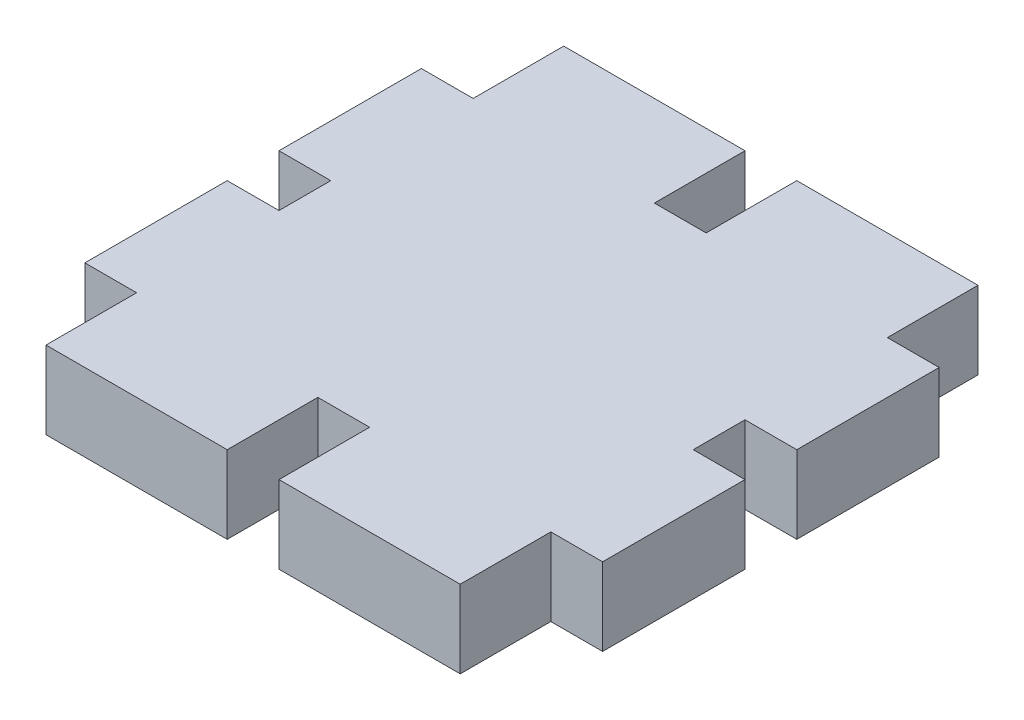
ISO-10303-21;
HEADER;
FILE_DESCRIPTION(('STEP AP214'),'2;1');
FILE_NAME('part.step','',(''),(''),'','','');
FILE_SCHEMA(('AUTOMOTIVE_DESIGN { 1 0 10303 214 1 1 1 1 }'));
ENDSEC;
DATA;
#1=APPLICATION_CONTEXT('core data for automotive mechanical design processes');
#2=APPLICATION_PROTOCOL_DEFINITION('international standard','automotive_design',2000,#1);
#3=PRODUCT_CONTEXT('',#1,'mechanical');
#4=PRODUCT('Part','Part','',(#3));
#5=PRODUCT_RELATED_PRODUCT_CATEGORY('part','',(#4));
#6=PRODUCT_DEFINITION_FORMATION('','',#4);
#7=PRODUCT_DEFINITION_CONTEXT('part definition',#1,'design');
#8=PRODUCT_DEFINITION('design','',#6,#7);
#9=PRODUCT_DEFINITION_SHAPE('','',#8);
#10=(LENGTH_UNIT() NAMED_UNIT(*) SI_UNIT(.MILLI.,.METRE.));
#11=(NAMED_UNIT(*) PLANE_ANGLE_UNIT() SI_UNIT($,.RADIAN.));
#12=(NAMED_UNIT(*) SI_UNIT($,.STERADIAN.) SOLID_ANGLE_UNIT());
#13=UNCERTAINTY_MEASURE_WITH_UNIT(LENGTH_MEASURE(1.E-05),#10,'distance_accuracy_value','');
#14=(GEOMETRIC_REPRESENTATION_CONTEXT(3) GLOBAL_UNCERTAINTY_ASSIGNED_CONTEXT((#13)) GLOBAL_UNIT_ASSIGNED_CONTEXT((#10,
#11,#12)) REPRESENTATION_CONTEXT('',''));
#15=CARTESIAN_POINT('',(0.,0.,0.));
#16=DIRECTION('',(0.,0.,1.));
#17=DIRECTION('',(1.,0.,0.));
#18=AXIS2_PLACEMENT_3D('',#15,#16,#17);
#19=CARTESIAN_POINT('',(1.,3.,0.));
#20=DIRECTION('',(-1.,0.,0.));
#21=DIRECTION('',(0.,0.,1.));
#22=AXIS2_PLACEMENT_3D('',#19,#20,#21);
#23=PLANE('',#22);
#24=DIRECTION('',(0.,0.,-1.));
#25=VECTOR('',#24,1.);
#26=CARTESIAN_POINT('',(1.,0.,0.));
#27=LINE('',#26,#25);
#28=CARTESIAN_POINT('',(1.,0.,-16.5));
#29=VERTEX_POINT('',#28);
#30=CARTESIAN_POINT('',(1.,0.,-20.));
#31=VERTEX_POINT('',#30);
#32=EDGE_CURVE('E253',#29,#31,#27,.T.);
#33=ORIENTED_EDGE('',*,*,#32,.F.);
#34=DIRECTION('',(0.,-1.,0.));
#35=VECTOR('',#34,1.);
#36=CARTESIAN_POINT('',(1.,3.,-16.5));
#37=LINE('',#36,#35);
#38=CARTESIAN_POINT('',(1.,3.,-16.5));
#39=VERTEX_POINT('',#38);
#40=EDGE_CURVE('E11',#39,#29,#37,.T.);
#41=ORIENTED_EDGE('',*,*,#40,.F.);
#42=DIRECTION('',(0.,0.,-1.));
#43=VECTOR('',#42,1.);
#44=CARTESIAN_POINT('',(1.,3.,0.));
#45=LINE('',#44,#43);
#46=CARTESIAN_POINT('',(1.,3.,-20.));
#47=VERTEX_POINT('',#46);
#48=EDGE_CURVE('E319',#39,#47,#45,.T.);
#49=ORIENTED_EDGE('',*,*,#48,.T.);
#50=DIRECTION('',(0.,-1.,0.));
#51=VECTOR('',#50,1.);
#52=CARTESIAN_POINT('',(1.,3.,-20.));
#53=LINE('',#52,#51);
#54=EDGE_CURVE('E55',#47,#31,#53,.T.);
#55=ORIENTED_EDGE('',*,*,#54,.T.);
#56=EDGE_LOOP('',(#33,#41,#49,#55));
#57=FACE_BOUND('',#56,.T.);
#58=ADVANCED_FACE('F39',(#57),#23,.T.);
#59=CARTESIAN_POINT('',(0.,3.,-16.5));
#60=DIRECTION('',(0.,0.,1.));
#61=DIRECTION('',(1.,0.,0.));
#62=AXIS2_PLACEMENT_3D('',#59,#60,#61);
#63=PLANE('',#62);
#64=DIRECTION('',(-1.,0.,0.));
#65=VECTOR('',#64,1.);
#66=CARTESIAN_POINT('',(0.,0.,-16.5));
#67=LINE('',#66,#65);
#68=CARTESIAN_POINT('',(-0.999999999999999,0.,-16.5));
#69=VERTEX_POINT('',#68);
#70=EDGE_CURVE('E255',#29,#69,#67,.T.);
#71=ORIENTED_EDGE('',*,*,#70,.T.);
#72=DIRECTION('',(0.,-1.,0.));
#73=VECTOR('',#72,1.);
#74=CARTESIAN_POINT('',(-0.999999999999999,3.,-16.5));
#75=LINE('',#74,#73);
#76=CARTESIAN_POINT('',(-0.999999999999999,3.,-16.5));
#77=VERTEX_POINT('',#76);
#78=EDGE_CURVE('E47',#77,#69,#75,.T.);
#79=ORIENTED_EDGE('',*,*,#78,.F.);
#80=DIRECTION('',(-1.,0.,0.));
#81=VECTOR('',#80,1.);
#82=CARTESIAN_POINT('',(0.,3.,-16.5));
#83=LINE('',#82,#81);
#84=EDGE_CURVE('E781',#39,#77,#83,.T.);
#85=ORIENTED_EDGE('',*,*,#84,.F.);
#86=ORIENTED_EDGE('',*,*,#40,.T.);
#87=EDGE_LOOP('',(#71,#79,#85,#86));
#88=FACE_BOUND('',#87,.T.);
#89=ADVANCED_FACE('F469',(#88),#63,.F.);
#90=CARTESIAN_POINT('',(-0.999999999999999,3.,0.));
#91=DIRECTION('',(-1.,0.,0.));
#92=DIRECTION('',(0.,0.,1.));
#93=AXIS2_PLACEMENT_3D('',#90,#91,#92);
#94=PLANE('',#93);
#95=DIRECTION('',(0.,0.,-1.));
#96=VECTOR('',#95,1.);
#97=CARTESIAN_POINT('',(-0.999999999999999,0.,0.));
#98=LINE('',#97,#96);
#99=CARTESIAN_POINT('',(-0.999999999999999,0.,-20.));
#100=VERTEX_POINT('',#99);
#101=EDGE_CURVE('E257',#69,#100,#98,.T.);
#102=ORIENTED_EDGE('',*,*,#101,.T.);
#103=DIRECTION('',(0.,-1.,0.));
#104=VECTOR('',#103,1.);
#105=CARTESIAN_POINT('',(-0.999999999999999,3.,-20.));
#106=LINE('',#105,#104);
#107=CARTESIAN_POINT('',(-0.999999999999999,3.,-20.));
#108=VERTEX_POINT('',#107);
#109=EDGE_CURVE('E377',#108,#100,#106,.T.);
#110=ORIENTED_EDGE('',*,*,#109,.F.);
#111=DIRECTION('',(0.,0.,-1.));
#112=VECTOR('',#111,1.);
#113=CARTESIAN_POINT('',(-0.999999999999999,3.,0.));
#114=LINE('',#113,#112);
#115=EDGE_CURVE('E386',#77,#108,#114,.T.);
#116=ORIENTED_EDGE('',*,*,#115,.F.);
#117=ORIENTED_EDGE('',*,*,#78,.T.);
#118=EDGE_LOOP('',(#102,#110,#116,#117));
#119=FACE_BOUND('',#118,.T.);
#120=ADVANCED_FACE('F384',(#119),#94,.F.);
#121=CARTESIAN_POINT('',(0.,3.,-20.));
#122=DIRECTION('',(0.,0.,1.));
#123=DIRECTION('',(1.,0.,0.));
#124=AXIS2_PLACEMENT_3D('',#121,#122,#123);
#125=PLANE('',#124);
#126=DIRECTION('',(-1.,0.,0.));
#127=VECTOR('',#126,1.);
#128=CARTESIAN_POINT('',(0.,0.,-20.));
#129=LINE('',#128,#127);
#130=CARTESIAN_POINT('',(-8.,0.,-20.));
#131=VERTEX_POINT('',#130);
#132=EDGE_CURVE('E259',#100,#131,#129,.T.);
#133=ORIENTED_EDGE('',*,*,#132,.T.);
#134=DIRECTION('',(0.,-1.,0.));
#135=VECTOR('',#134,1.);
#136=CARTESIAN_POINT('',(-8.,3.,-20.));
#137=LINE('',#136,#135);
#138=CARTESIAN_POINT('',(-8.,3.,-20.));
#139=VERTEX_POINT('',#138);
#140=EDGE_CURVE('E374',#139,#131,#137,.T.);
#141=ORIENTED_EDGE('',*,*,#140,.F.);
#142=DIRECTION('',(-1.,0.,0.));
#143=VECTOR('',#142,1.);
#144=CARTESIAN_POINT('',(0.,3.,-20.));
#145=LINE('',#144,#143);
#146=EDGE_CURVE('E405',#108,#139,#145,.T.);
#147=ORIENTED_EDGE('',*,*,#146,.F.);
#148=ORIENTED_EDGE('',*,*,#109,.T.);
#149=EDGE_LOOP('',(#133,#141,#147,#148));
#150=FACE_BOUND('',#149,.T.);
#151=ADVANCED_FACE('F396',(#150),#125,.F.);
#152=CARTESIAN_POINT('',(-8.,3.,0.));
#153=DIRECTION('',(1.,0.,0.));
#154=DIRECTION('',(0.,0.,-1.));
#155=AXIS2_PLACEMENT_3D('',#152,#153,#154);
#156=PLANE('',#155);
#157=DIRECTION('',(0.,0.,1.));
#158=VECTOR('',#157,1.);
#159=CARTESIAN_POINT('',(-8.,0.,0.));
#160=LINE('',#159,#158);
#161=CARTESIAN_POINT('',(-8.,0.,-16.5));
#162=VERTEX_POINT('',#161);
#163=EDGE_CURVE('E261',#131,#162,#160,.T.);
#164=ORIENTED_EDGE('',*,*,#163,.T.);
#165=DIRECTION('',(0.,-1.,0.));
#166=VECTOR('',#165,1.);
#167=CARTESIAN_POINT('',(-8.,3.,-16.5));
#168=LINE('',#167,#166);
#169=CARTESIAN_POINT('',(-8.,3.,-16.5));
#170=VERTEX_POINT('',#169);
#171=EDGE_CURVE('E371',#170,#162,#168,.T.);
#172=ORIENTED_EDGE('',*,*,#171,.F.);
#173=DIRECTION('',(0.,0.,1.));
#174=VECTOR('',#173,1.);
#175=CARTESIAN_POINT('',(-8.,3.,0.));
#176=LINE('',#175,#174);
#177=EDGE_CURVE('E402',#139,#170,#176,.T.);
#178=ORIENTED_EDGE('',*,*,#177,.F.);
#179=ORIENTED_EDGE('',*,*,#140,.T.);
#180=EDGE_LOOP('',(#164,#172,#178,#179));
#181=FACE_BOUND('',#180,.T.);
#182=ADVANCED_FACE('F400',(#181),#156,.F.);
#183=CARTESIAN_POINT('',(0.,3.,-16.5));
#184=DIRECTION('',(0.,0.,1.));
#185=DIRECTION('',(1.,0.,0.));
#186=AXIS2_PLACEMENT_3D('',#183,#184,#185);
#187=PLANE('',#186);
#188=DIRECTION('',(-1.,0.,0.));
#189=VECTOR('',#188,1.);
#190=CARTESIAN_POINT('',(0.,0.,-16.5));
#191=LINE('',#190,#189);
#192=CARTESIAN_POINT('',(-10.,0.,-16.5));
#193=VERTEX_POINT('',#192);
#194=EDGE_CURVE('E263',#162,#193,#191,.T.);
#195=ORIENTED_EDGE('',*,*,#194,.T.);
#196=DIRECTION('',(0.,-1.,0.));
#197=VECTOR('',#196,1.);
#198=CARTESIAN_POINT('',(-10.,3.,-16.5));
#199=LINE('',#198,#197);
#200=CARTESIAN_POINT('',(-10.,3.,-16.5));
#201=VERTEX_POINT('',#200);
#202=EDGE_CURVE('E368',#201,#193,#199,.T.);
#203=ORIENTED_EDGE('',*,*,#202,.F.);
#204=DIRECTION('',(-1.,0.,0.));
#205=VECTOR('',#204,1.);
#206=CARTESIAN_POINT('',(0.,3.,-16.5));
#207=LINE('',#206,#205);
#208=EDGE_CURVE('E404',#170,#201,#207,.T.);
#209=ORIENTED_EDGE('',*,*,#208,.F.);
#210=ORIENTED_EDGE('',*,*,#171,.T.);
#211=EDGE_LOOP('',(#195,#203,#209,#210));
#212=FACE_BOUND('',#211,.T.);
#213=ADVANCED_FACE('F482',(#212),#187,.F.);
#214=CARTESIAN_POINT('',(-10.,3.,0.));
#215=DIRECTION('',(1.,0.,0.));
#216=DIRECTION('',(0.,0.,-1.));
#217=AXIS2_PLACEMENT_3D('',#214,#215,#216);
#218=PLANE('',#217);
#219=DIRECTION('',(0.,0.,1.));
#220=VECTOR('',#219,1.);
#221=CARTESIAN_POINT('',(-10.,0.,0.));
#222=LINE('',#221,#220);
#223=CARTESIAN_POINT('',(-10.,0.,-11.));
#224=VERTEX_POINT('',#223);
#225=EDGE_CURVE('E265',#193,#224,#222,.T.);
#226=ORIENTED_EDGE('',*,*,#225,.T.);
#227=DIRECTION('',(0.,-1.,0.));
#228=VECTOR('',#227,1.);
#229=CARTESIAN_POINT('',(-10.,3.,-11.));
#230=LINE('',#229,#228);
#231=CARTESIAN_POINT('',(-10.,3.,-11.));
#232=VERTEX_POINT('',#231);
#233=EDGE_CURVE('E365',#232,#224,#230,.T.);
#234=ORIENTED_EDGE('',*,*,#233,.F.);
#235=DIRECTION('',(0.,0.,1.));
#236=VECTOR('',#235,1.);
#237=CARTESIAN_POINT('',(-10.,3.,0.));
#238=LINE('',#237,#236);
#239=EDGE_CURVE('E407',#201,#232,#238,.T.);
#240=ORIENTED_EDGE('',*,*,#239,.F.);
#241=ORIENTED_EDGE('',*,*,#202,.T.);
#242=EDGE_LOOP('',(#226,#234,#240,#241));
#243=FACE_BOUND('',#242,.T.);
#244=ADVANCED_FACE('F485',(#243),#218,.F.);
#245=CARTESIAN_POINT('',(0.,3.,-11.));
#246=DIRECTION('',(0.,0.,-1.));
#247=DIRECTION('',(-1.,0.,0.));
#248=AXIS2_PLACEMENT_3D('',#245,#246,#247);
#249=PLANE('',#248);
#250=DIRECTION('',(1.,0.,0.));
#251=VECTOR('',#250,1.);
#252=CARTESIAN_POINT('',(0.,0.,-11.));
#253=LINE('',#252,#251);
#254=CARTESIAN_POINT('',(-8.,0.,-11.));
#255=VERTEX_POINT('',#254);
#256=EDGE_CURVE('E267',#224,#255,#253,.T.);
#257=ORIENTED_EDGE('',*,*,#256,.T.);
#258=DIRECTION('',(0.,-1.,0.));
#259=VECTOR('',#258,1.);
#260=CARTESIAN_POINT('',(-8.,3.,-11.));
#261=LINE('',#260,#259);
#262=CARTESIAN_POINT('',(-8.,3.,-11.));
#263=VERTEX_POINT('',#262);
#264=EDGE_CURVE('E362',#263,#255,#261,.T.);
#265=ORIENTED_EDGE('',*,*,#264,.F.);
#266=DIRECTION('',(1.,0.,0.));
#267=VECTOR('',#266,1.);
#268=CARTESIAN_POINT('',(0.,3.,-11.));
#269=LINE('',#268,#267);
#270=EDGE_CURVE('E413',#232,#263,#269,.T.);
#271=ORIENTED_EDGE('',*,*,#270,.F.);
#272=ORIENTED_EDGE('',*,*,#233,.T.);
#273=EDGE_LOOP('',(#257,#265,#271,#272));
#274=FACE_BOUND('',#273,.T.);
#275=ADVANCED_FACE('F489',(#274),#249,.F.);
#276=CARTESIAN_POINT('',(-8.,3.,0.));
#277=DIRECTION('',(1.,0.,0.));
#278=DIRECTION('',(0.,0.,-1.));
#279=AXIS2_PLACEMENT_3D('',#276,#277,#278);
#280=PLANE('',#279);
#281=DIRECTION('',(0.,0.,1.));
#282=VECTOR('',#281,1.);
#283=CARTESIAN_POINT('',(-8.,0.,0.));
#284=LINE('',#283,#282);
#285=CARTESIAN_POINT('',(-8.,0.,-9.));
#286=VERTEX_POINT('',#285);
#287=EDGE_CURVE('E269',#255,#286,#284,.T.);
#288=ORIENTED_EDGE('',*,*,#287,.T.);
#289=DIRECTION('',(0.,-1.,0.));
#290=VECTOR('',#289,1.);
#291=CARTESIAN_POINT('',(-8.,3.,-9.));
#292=LINE('',#291,#290);
#293=CARTESIAN_POINT('',(-8.,3.,-9.));
#294=VERTEX_POINT('',#293);
#295=EDGE_CURVE('E359',#294,#286,#292,.T.);
#296=ORIENTED_EDGE('',*,*,#295,.F.);
#297=DIRECTION('',(0.,0.,1.));
#298=VECTOR('',#297,1.);
#299=CARTESIAN_POINT('',(-8.,3.,0.));
#300=LINE('',#299,#298);
#301=EDGE_CURVE('E415',#263,#294,#300,.T.);
#302=ORIENTED_EDGE('',*,*,#301,.F.);
#303=ORIENTED_EDGE('',*,*,#264,.T.);
#304=EDGE_LOOP('',(#288,#296,#302,#303));
#305=FACE_BOUND('',#304,.T.);
#306=ADVANCED_FACE('F493',(#305),#280,.F.);
#307=CARTESIAN_POINT('',(0.,3.,-9.));
#308=DIRECTION('',(0.,0.,1.));
#309=DIRECTION('',(1.,0.,0.));
#310=AXIS2_PLACEMENT_3D('',#307,#308,#309);
#311=PLANE('',#310);
#312=DIRECTION('',(-1.,0.,0.));
#313=VECTOR('',#312,1.);
#314=CARTESIAN_POINT('',(0.,0.,-9.));
#315=LINE('',#314,#313);
#316=CARTESIAN_POINT('',(-10.,0.,-9.));
#317=VERTEX_POINT('',#316);
#318=EDGE_CURVE('E271',#286,#317,#315,.T.);
#319=ORIENTED_EDGE('',*,*,#318,.T.);
#320=DIRECTION('',(0.,-1.,0.));
#321=VECTOR('',#320,1.);
#322=CARTESIAN_POINT('',(-10.,3.,-9.));
#323=LINE('',#322,#321);
#324=CARTESIAN_POINT('',(-10.,3.,-9.));
#325=VERTEX_POINT('',#324);
#326=EDGE_CURVE('E356',#325,#317,#323,.T.);
#327=ORIENTED_EDGE('',*,*,#326,.F.);
#328=DIRECTION('',(-1.,0.,0.));
#329=VECTOR('',#328,1.);
#330=CARTESIAN_POINT('',(0.,3.,-9.));
#331=LINE('',#330,#329);
#332=EDGE_CURVE('E417',#294,#325,#331,.T.);
#333=ORIENTED_EDGE('',*,*,#332,.F.);
#334=ORIENTED_EDGE('',*,*,#295,.T.);
#335=EDGE_LOOP('',(#319,#327,#333,#334));
#336=FACE_BOUND('',#335,.T.);
#337=ADVANCED_FACE('F497',(#336),#311,.F.);
#338=CARTESIAN_POINT('',(-10.,3.,0.));
#339=DIRECTION('',(1.,0.,0.));
#340=DIRECTION('',(0.,0.,-1.));
#341=AXIS2_PLACEMENT_3D('',#338,#339,#340);
#342=PLANE('',#341);
#343=DIRECTION('',(0.,0.,1.));
#344=VECTOR('',#343,1.);
#345=CARTESIAN_POINT('',(-10.,0.,0.));
#346=LINE('',#345,#344);
#347=CARTESIAN_POINT('',(-10.,0.,-3.5));
#348=VERTEX_POINT('',#347);
#349=EDGE_CURVE('E273',#317,#348,#346,.T.);
#350=ORIENTED_EDGE('',*,*,#349,.T.);
#351=DIRECTION('',(0.,-1.,0.));
#352=VECTOR('',#351,1.);
#353=CARTESIAN_POINT('',(-10.,3.,-3.5));
#354=LINE('',#353,#352);
#355=CARTESIAN_POINT('',(-10.,3.,-3.5));
#356=VERTEX_POINT('',#355);
#357=EDGE_CURVE('E353',#356,#348,#354,.T.);
#358=ORIENTED_EDGE('',*,*,#357,.F.);
#359=DIRECTION('',(0.,0.,1.));
#360=VECTOR('',#359,1.);
#361=CARTESIAN_POINT('',(-10.,3.,0.));
#362=LINE('',#361,#360);
#363=EDGE_CURVE('E419',#325,#356,#362,.T.);
#364=ORIENTED_EDGE('',*,*,#363,.F.);
#365=ORIENTED_EDGE('',*,*,#326,.T.);
#366=EDGE_LOOP('',(#350,#358,#364,#365));
#367=FACE_BOUND('',#366,.T.);
#368=ADVANCED_FACE('F501',(#367),#342,.F.);
#369=CARTESIAN_POINT('',(0.,3.,-3.5));
#370=DIRECTION('',(0.,0.,-1.));
#371=DIRECTION('',(-1.,0.,0.));
#372=AXIS2_PLACEMENT_3D('',#369,#370,#371);
#373=PLANE('',#372);
#374=DIRECTION('',(1.,0.,0.));
#375=VECTOR('',#374,1.);
#376=CARTESIAN_POINT('',(0.,0.,-3.5));
#377=LINE('',#376,#375);
#378=CARTESIAN_POINT('',(-8.,0.,-3.5));
#379=VERTEX_POINT('',#378);
#380=EDGE_CURVE('E275',#348,#379,#377,.T.);
#381=ORIENTED_EDGE('',*,*,#380,.T.);
#382=DIRECTION('',(0.,-1.,0.));
#383=VECTOR('',#382,1.);
#384=CARTESIAN_POINT('',(-8.,3.,-3.5));
#385=LINE('',#384,#383);
#386=CARTESIAN_POINT('',(-8.,3.,-3.5));
#387=VERTEX_POINT('',#386);
#388=EDGE_CURVE('E350',#387,#379,#385,.T.);
#389=ORIENTED_EDGE('',*,*,#388,.F.);
#390=DIRECTION('',(1.,0.,0.));
#391=VECTOR('',#390,1.);
#392=CARTESIAN_POINT('',(0.,3.,-3.5));
#393=LINE('',#392,#391);
#394=EDGE_CURVE('E421',#356,#387,#393,.T.);
#395=ORIENTED_EDGE('',*,*,#394,.F.);
#396=ORIENTED_EDGE('',*,*,#357,.T.);
#397=EDGE_LOOP('',(#381,#389,#395,#396));
#398=FACE_BOUND('',#397,.T.);
#399=ADVANCED_FACE('F505',(#398),#373,.F.);
#400=CARTESIAN_POINT('',(-8.,3.,0.));
#401=DIRECTION('',(1.,0.,0.));
#402=DIRECTION('',(0.,0.,-1.));
#403=AXIS2_PLACEMENT_3D('',#400,#401,#402);
#404=PLANE('',#403);
#405=DIRECTION('',(0.,0.,1.));
#406=VECTOR('',#405,1.);
#407=CARTESIAN_POINT('',(-8.,0.,0.));
#408=LINE('',#407,#406);
#409=CARTESIAN_POINT('',(-8.,0.,0.));
#410=VERTEX_POINT('',#409);
#411=EDGE_CURVE('E277',#379,#410,#408,.T.);
#412=ORIENTED_EDGE('',*,*,#411,.T.);
#413=DIRECTION('',(0.,-1.,0.));
#414=VECTOR('',#413,1.);
#415=CARTESIAN_POINT('',(-8.,3.,0.));
#416=LINE('',#415,#414);
#417=CARTESIAN_POINT('',(-8.,3.,0.));
#418=VERTEX_POINT('',#417);
#419=EDGE_CURVE('E347',#418,#410,#416,.T.);
#420=ORIENTED_EDGE('',*,*,#419,.F.);
#421=DIRECTION('',(0.,0.,1.));
#422=VECTOR('',#421,1.);
#423=CARTESIAN_POINT('',(-8.,3.,0.));
#424=LINE('',#423,#422);
#425=EDGE_CURVE('E423',#387,#418,#424,.T.);
#426=ORIENTED_EDGE('',*,*,#425,.F.);
#427=ORIENTED_EDGE('',*,*,#388,.T.);
#428=EDGE_LOOP('',(#412,#420,#426,#427));
#429=FACE_BOUND('',#428,.T.);
#430=ADVANCED_FACE('F509',(#429),#404,.F.);
#431=CARTESIAN_POINT('',(0.,3.,0.));
#432=DIRECTION('',(0.,0.,-1.));
#433=DIRECTION('',(-1.,0.,0.));
#434=AXIS2_PLACEMENT_3D('',#431,#432,#433);
#435=PLANE('',#434);
#436=DIRECTION('',(1.,0.,0.));
#437=VECTOR('',#436,1.);
#438=CARTESIAN_POINT('',(0.,0.,0.));
#439=LINE('',#438,#437);
#440=CARTESIAN_POINT('',(-0.999999999999999,0.,0.));
#441=VERTEX_POINT('',#440);
#442=EDGE_CURVE('E279',#410,#441,#439,.T.);
#443=ORIENTED_EDGE('',*,*,#442,.T.);
#444=DIRECTION('',(0.,-1.,0.));
#445=VECTOR('',#444,1.);
#446=CARTESIAN_POINT('',(-0.999999999999999,3.,0.));
#447=LINE('',#446,#445);
#448=CARTESIAN_POINT('',(-0.999999999999999,3.,0.));
#449=VERTEX_POINT('',#448);
#450=EDGE_CURVE('E344',#449,#441,#447,.T.);
#451=ORIENTED_EDGE('',*,*,#450,.F.);
#452=DIRECTION('',(1.,0.,0.));
#453=VECTOR('',#452,1.);
#454=CARTESIAN_POINT('',(0.,3.,0.));
#455=LINE('',#454,#453);
#456=EDGE_CURVE('E425',#418,#449,#455,.T.);
#457=ORIENTED_EDGE('',*,*,#456,.F.);
#458=ORIENTED_EDGE('',*,*,#419,.T.);
#459=EDGE_LOOP('',(#443,#451,#457,#458));
#460=FACE_BOUND('',#459,.T.);
#461=ADVANCED_FACE('F513',(#460),#435,.F.);
#462=CARTESIAN_POINT('',(-0.999999999999999,3.,0.));
#463=DIRECTION('',(-1.,0.,0.));
#464=DIRECTION('',(0.,0.,1.));
#465=AXIS2_PLACEMENT_3D('',#462,#463,#464);
#466=PLANE('',#465);
#467=DIRECTION('',(0.,0.,-1.));
#468=VECTOR('',#467,1.);
#469=CARTESIAN_POINT('',(-0.999999999999999,0.,0.));
#470=LINE('',#469,#468);
#471=CARTESIAN_POINT('',(-0.999999999999999,0.,-3.5));
#472=VERTEX_POINT('',#471);
#473=EDGE_CURVE('E281',#441,#472,#470,.T.);
#474=ORIENTED_EDGE('',*,*,#473,.T.);
#475=DIRECTION('',(0.,-1.,0.));
#476=VECTOR('',#475,1.);
#477=CARTESIAN_POINT('',(-0.999999999999999,3.,-3.5));
#478=LINE('',#477,#476);
#479=CARTESIAN_POINT('',(-0.999999999999999,3.,-3.5));
#480=VERTEX_POINT('',#479);
#481=EDGE_CURVE('E341',#480,#472,#478,.T.);
#482=ORIENTED_EDGE('',*,*,#481,.F.);
#483=DIRECTION('',(0.,0.,-1.));
#484=VECTOR('',#483,1.);
#485=CARTESIAN_POINT('',(-0.999999999999999,3.,0.));
#486=LINE('',#485,#484);
#487=EDGE_CURVE('E427',#449,#480,#486,.T.);
#488=ORIENTED_EDGE('',*,*,#487,.F.);
#489=ORIENTED_EDGE('',*,*,#450,.T.);
#490=EDGE_LOOP('',(#474,#482,#488,#489));
#491=FACE_BOUND('',#490,.T.);
#492=ADVANCED_FACE('F517',(#491),#466,.F.);
#493=CARTESIAN_POINT('',(0.,3.,-3.5));
#494=DIRECTION('',(0.,0.,-1.));
#495=DIRECTION('',(-1.,0.,0.));
#496=AXIS2_PLACEMENT_3D('',#493,#494,#495);
#497=PLANE('',#496);
#498=DIRECTION('',(1.,0.,0.));
#499=VECTOR('',#498,1.);
#500=CARTESIAN_POINT('',(0.,0.,-3.5));
#501=LINE('',#500,#499);
#502=CARTESIAN_POINT('',(1.,0.,-3.5));
#503=VERTEX_POINT('',#502);
#504=EDGE_CURVE('E283',#472,#503,#501,.T.);
#505=ORIENTED_EDGE('',*,*,#504,.T.);
#506=DIRECTION('',(0.,-1.,0.));
#507=VECTOR('',#506,1.);
#508=CARTESIAN_POINT('',(1.,3.,-3.5));
#509=LINE('',#508,#507);
#510=CARTESIAN_POINT('',(1.,3.,-3.5));
#511=VERTEX_POINT('',#510);
#512=EDGE_CURVE('E339',#511,#503,#509,.T.);
#513=ORIENTED_EDGE('',*,*,#512,.F.);
#514=DIRECTION('',(1.,0.,0.));
#515=VECTOR('',#514,1.);
#516=CARTESIAN_POINT('',(0.,3.,-3.5));
#517=LINE('',#516,#515);
#518=EDGE_CURVE('E429',#480,#511,#517,.T.);
#519=ORIENTED_EDGE('',*,*,#518,.F.);
#520=ORIENTED_EDGE('',*,*,#481,.T.);
#521=EDGE_LOOP('',(#505,#513,#519,#520));
#522=FACE_BOUND('',#521,.T.);
#523=ADVANCED_FACE('F521',(#522),#497,.F.);
#524=CARTESIAN_POINT('',(1.00000000000001,3.,0.));
#525=DIRECTION('',(-1.,0.,0.));
#526=DIRECTION('',(0.,0.,1.));
#527=AXIS2_PLACEMENT_3D('',#524,#525,#526);
#528=PLANE('',#527);
#529=DIRECTION('',(0.,0.,-1.));
#530=VECTOR('',#529,1.);
#531=CARTESIAN_POINT('',(1.00000000000001,0.,0.));
#532=LINE('',#531,#530);
#533=CARTESIAN_POINT('',(1.00000000000001,0.,0.));
#534=VERTEX_POINT('',#533);
#535=EDGE_CURVE('E286',#534,#503,#532,.T.);
#536=ORIENTED_EDGE('',*,*,#535,.F.);
#537=DIRECTION('',(0.,-1.,0.));
#538=VECTOR('',#537,1.);
#539=CARTESIAN_POINT('',(1.00000000000001,3.,0.));
#540=LINE('',#539,#538);
#541=CARTESIAN_POINT('',(1.00000000000001,3.,0.));
#542=VERTEX_POINT('',#541);
#543=EDGE_CURVE('E337',#542,#534,#540,.T.);
#544=ORIENTED_EDGE('',*,*,#543,.F.);
#545=DIRECTION('',(0.,0.,-1.));
#546=VECTOR('',#545,1.);
#547=CARTESIAN_POINT('',(1.00000000000001,3.,0.));
#548=LINE('',#547,#546);
#549=EDGE_CURVE('E431',#542,#511,#548,.T.);
#550=ORIENTED_EDGE('',*,*,#549,.T.);
#551=ORIENTED_EDGE('',*,*,#512,.T.);
#552=EDGE_LOOP('',(#536,#544,#550,#551));
#553=FACE_BOUND('',#552,.T.);
#554=ADVANCED_FACE('F525',(#553),#528,.T.);
#555=CARTESIAN_POINT('',(0.,3.,0.));
#556=DIRECTION('',(0.,0.,1.));
#557=DIRECTION('',(1.,0.,0.));
#558=AXIS2_PLACEMENT_3D('',#555,#556,#557);
#559=PLANE('',#558);
#560=DIRECTION('',(-1.,0.,0.));
#561=VECTOR('',#560,1.);
#562=CARTESIAN_POINT('',(0.,0.,0.));
#563=LINE('',#562,#561);
#564=CARTESIAN_POINT('',(8.00000000000001,0.,0.));
#565=VERTEX_POINT('',#564);
#566=EDGE_CURVE('E289',#565,#534,#563,.T.);
#567=ORIENTED_EDGE('',*,*,#566,.F.);
#568=DIRECTION('',(0.,-1.,0.));
#569=VECTOR('',#568,1.);
#570=CARTESIAN_POINT('',(8.00000000000001,3.,0.));
#571=LINE('',#570,#569);
#572=CARTESIAN_POINT('',(8.00000000000001,3.,0.));
#573=VERTEX_POINT('',#572);
#574=EDGE_CURVE('E335',#573,#565,#571,.T.);
#575=ORIENTED_EDGE('',*,*,#574,.F.);
#576=DIRECTION('',(-1.,0.,0.));
#577=VECTOR('',#576,1.);
#578=CARTESIAN_POINT('',(0.,3.,0.));
#579=LINE('',#578,#577);
#580=EDGE_CURVE('E434',#573,#542,#579,.T.);
#581=ORIENTED_EDGE('',*,*,#580,.T.);
#582=ORIENTED_EDGE('',*,*,#543,.T.);
#583=EDGE_LOOP('',(#567,#575,#581,#582));
#584=FACE_BOUND('',#583,.T.);
#585=ADVANCED_FACE('F529',(#584),#559,.T.);
#586=CARTESIAN_POINT('',(8.00000000000001,3.,0.));
#587=DIRECTION('',(1.,0.,0.));
#588=DIRECTION('',(0.,0.,-1.));
#589=AXIS2_PLACEMENT_3D('',#586,#587,#588);
#590=PLANE('',#589);
#591=DIRECTION('',(0.,0.,1.));
#592=VECTOR('',#591,1.);
#593=CARTESIAN_POINT('',(8.00000000000001,0.,0.));
#594=LINE('',#593,#592);
#595=CARTESIAN_POINT('',(8.00000000000001,0.,-3.5));
#596=VERTEX_POINT('',#595);
#597=EDGE_CURVE('E292',#596,#565,#594,.T.);
#598=ORIENTED_EDGE('',*,*,#597,.F.);
#599=DIRECTION('',(0.,-1.,0.));
#600=VECTOR('',#599,1.);
#601=CARTESIAN_POINT('',(8.00000000000001,3.,-3.5));
#602=LINE('',#601,#600);
#603=CARTESIAN_POINT('',(8.00000000000001,3.,-3.5));
#604=VERTEX_POINT('',#603);
#605=EDGE_CURVE('E333',#604,#596,#602,.T.);
#606=ORIENTED_EDGE('',*,*,#605,.F.);
#607=DIRECTION('',(0.,0.,1.));
#608=VECTOR('',#607,1.);
#609=CARTESIAN_POINT('',(8.00000000000001,3.,0.));
#610=LINE('',#609,#608);
#611=EDGE_CURVE('E437',#604,#573,#610,.T.);
#612=ORIENTED_EDGE('',*,*,#611,.T.);
#613=ORIENTED_EDGE('',*,*,#574,.T.);
#614=EDGE_LOOP('',(#598,#606,#612,#613));
#615=FACE_BOUND('',#614,.T.);
#616=ADVANCED_FACE('F533',(#615),#590,.T.);
#617=CARTESIAN_POINT('',(0.,3.,-3.5));
#618=DIRECTION('',(0.,0.,1.));
#619=DIRECTION('',(1.,0.,0.));
#620=AXIS2_PLACEMENT_3D('',#617,#618,#619);
#621=PLANE('',#620);
#622=DIRECTION('',(-1.,0.,0.));
#623=VECTOR('',#622,1.);
#624=CARTESIAN_POINT('',(0.,0.,-3.5));
#625=LINE('',#624,#623);
#626=CARTESIAN_POINT('',(10.,0.,-3.5));
#627=VERTEX_POINT('',#626);
#628=EDGE_CURVE('E295',#627,#596,#625,.T.);
#629=ORIENTED_EDGE('',*,*,#628,.F.);
#630=DIRECTION('',(0.,-1.,0.));
#631=VECTOR('',#630,1.);
#632=CARTESIAN_POINT('',(10.,3.,-3.5));
#633=LINE('',#632,#631);
#634=CARTESIAN_POINT('',(10.,3.,-3.5));
#635=VERTEX_POINT('',#634);
#636=EDGE_CURVE('E331',#635,#627,#633,.T.);
#637=ORIENTED_EDGE('',*,*,#636,.F.);
#638=DIRECTION('',(-1.,0.,0.));
#639=VECTOR('',#638,1.);
#640=CARTESIAN_POINT('',(0.,3.,-3.5));
#641=LINE('',#640,#639);
#642=EDGE_CURVE('E440',#635,#604,#641,.T.);
#643=ORIENTED_EDGE('',*,*,#642,.T.);
#644=ORIENTED_EDGE('',*,*,#605,.T.);
#645=EDGE_LOOP('',(#629,#637,#643,#644));
#646=FACE_BOUND('',#645,.T.);
#647=ADVANCED_FACE('F537',(#646),#621,.T.);
#648=CARTESIAN_POINT('',(10.,3.,0.));
#649=DIRECTION('',(1.,0.,0.));
#650=DIRECTION('',(0.,0.,-1.));
#651=AXIS2_PLACEMENT_3D('',#648,#649,#650);
#652=PLANE('',#651);
#653=DIRECTION('',(0.,0.,1.));
#654=VECTOR('',#653,1.);
#655=CARTESIAN_POINT('',(10.,0.,0.));
#656=LINE('',#655,#654);
#657=CARTESIAN_POINT('',(10.,0.,-9.));
#658=VERTEX_POINT('',#657);
#659=EDGE_CURVE('E298',#658,#627,#656,.T.);
#660=ORIENTED_EDGE('',*,*,#659,.F.);
#661=DIRECTION('',(0.,-1.,0.));
#662=VECTOR('',#661,1.);
#663=CARTESIAN_POINT('',(10.,3.,-9.));
#664=LINE('',#663,#662);
#665=CARTESIAN_POINT('',(10.,3.,-9.));
#666=VERTEX_POINT('',#665);
#667=EDGE_CURVE('E329',#666,#658,#664,.T.);
#668=ORIENTED_EDGE('',*,*,#667,.F.);
#669=DIRECTION('',(0.,0.,1.));
#670=VECTOR('',#669,1.);
#671=CARTESIAN_POINT('',(10.,3.,0.));
#672=LINE('',#671,#670);
#673=EDGE_CURVE('E443',#666,#635,#672,.T.);
#674=ORIENTED_EDGE('',*,*,#673,.T.);
#675=ORIENTED_EDGE('',*,*,#636,.T.);
#676=EDGE_LOOP('',(#660,#668,#674,#675));
#677=FACE_BOUND('',#676,.T.);
#678=ADVANCED_FACE('F541',(#677),#652,.T.);
#679=CARTESIAN_POINT('',(0.,3.,-9.));
#680=DIRECTION('',(0.,0.,-1.));
#681=DIRECTION('',(-1.,0.,0.));
#682=AXIS2_PLACEMENT_3D('',#679,#680,#681);
#683=PLANE('',#682);
#684=DIRECTION('',(1.,0.,0.));
#685=VECTOR('',#684,1.);
#686=CARTESIAN_POINT('',(0.,0.,-9.));
#687=LINE('',#686,#685);
#688=CARTESIAN_POINT('',(8.00000000000001,0.,-9.));
#689=VERTEX_POINT('',#688);
#690=EDGE_CURVE('E301',#689,#658,#687,.T.);
#691=ORIENTED_EDGE('',*,*,#690,.F.);
#692=DIRECTION('',(0.,-1.,0.));
#693=VECTOR('',#692,1.);
#694=CARTESIAN_POINT('',(8.00000000000001,3.,-9.));
#695=LINE('',#694,#693);
#696=CARTESIAN_POINT('',(8.00000000000001,3.,-9.));
#697=VERTEX_POINT('',#696);
#698=EDGE_CURVE('E327',#697,#689,#695,.T.);
#699=ORIENTED_EDGE('',*,*,#698,.F.);
#700=DIRECTION('',(1.,0.,0.));
#701=VECTOR('',#700,1.);
#702=CARTESIAN_POINT('',(0.,3.,-9.));
#703=LINE('',#702,#701);
#704=EDGE_CURVE('E446',#697,#666,#703,.T.);
#705=ORIENTED_EDGE('',*,*,#704,.T.);
#706=ORIENTED_EDGE('',*,*,#667,.T.);
#707=EDGE_LOOP('',(#691,#699,#705,#706));
#708=FACE_BOUND('',#707,.T.);
#709=ADVANCED_FACE('F545',(#708),#683,.T.);
#710=CARTESIAN_POINT('',(8.00000000000001,3.,0.));
#711=DIRECTION('',(1.,0.,0.));
#712=DIRECTION('',(0.,0.,-1.));
#713=AXIS2_PLACEMENT_3D('',#710,#711,#712);
#714=PLANE('',#713);
#715=DIRECTION('',(0.,0.,1.));
#716=VECTOR('',#715,1.);
#717=CARTESIAN_POINT('',(8.00000000000001,0.,0.));
#718=LINE('',#717,#716);
#719=CARTESIAN_POINT('',(8.00000000000001,0.,-11.));
#720=VERTEX_POINT('',#719);
#721=EDGE_CURVE('E304',#720,#689,#718,.T.);
#722=ORIENTED_EDGE('',*,*,#721,.F.);
#723=DIRECTION('',(0.,-1.,0.));
#724=VECTOR('',#723,1.);
#725=CARTESIAN_POINT('',(8.00000000000001,3.,-11.));
#726=LINE('',#725,#724);
#727=CARTESIAN_POINT('',(8.00000000000001,3.,-11.));
#728=VERTEX_POINT('',#727);
#729=EDGE_CURVE('E325',#728,#720,#726,.T.);
#730=ORIENTED_EDGE('',*,*,#729,.F.);
#731=DIRECTION('',(0.,0.,1.));
#732=VECTOR('',#731,1.);
#733=CARTESIAN_POINT('',(8.00000000000001,3.,0.));
#734=LINE('',#733,#732);
#735=EDGE_CURVE('E449',#728,#697,#734,.T.);
#736=ORIENTED_EDGE('',*,*,#735,.T.);
#737=ORIENTED_EDGE('',*,*,#698,.T.);
#738=EDGE_LOOP('',(#722,#730,#736,#737));
#739=FACE_BOUND('',#738,.T.);
#740=ADVANCED_FACE('F549',(#739),#714,.T.);
#741=CARTESIAN_POINT('',(0.,3.,-11.));
#742=DIRECTION('',(0.,0.,1.));
#743=DIRECTION('',(1.,0.,0.));
#744=AXIS2_PLACEMENT_3D('',#741,#742,#743);
#745=PLANE('',#744);
#746=DIRECTION('',(-1.,0.,0.));
#747=VECTOR('',#746,1.);
#748=CARTESIAN_POINT('',(0.,0.,-11.));
#749=LINE('',#748,#747);
#750=CARTESIAN_POINT('',(10.,0.,-11.));
#751=VERTEX_POINT('',#750);
#752=EDGE_CURVE('E307',#751,#720,#749,.T.);
#753=ORIENTED_EDGE('',*,*,#752,.F.);
#754=DIRECTION('',(0.,-1.,0.));
#755=VECTOR('',#754,1.);
#756=CARTESIAN_POINT('',(10.,3.,-11.));
#757=LINE('',#756,#755);
#758=CARTESIAN_POINT('',(10.,3.,-11.));
#759=VERTEX_POINT('',#758);
#760=EDGE_CURVE('E323',#759,#751,#757,.T.);
#761=ORIENTED_EDGE('',*,*,#760,.F.);
#762=DIRECTION('',(-1.,0.,0.));
#763=VECTOR('',#762,1.);
#764=CARTESIAN_POINT('',(0.,3.,-11.));
#765=LINE('',#764,#763);
#766=EDGE_CURVE('E452',#759,#728,#765,.T.);
#767=ORIENTED_EDGE('',*,*,#766,.T.);
#768=ORIENTED_EDGE('',*,*,#729,.T.);
#769=EDGE_LOOP('',(#753,#761,#767,#768));
#770=FACE_BOUND('',#769,.T.);
#771=ADVANCED_FACE('F553',(#770),#745,.T.);
#772=CARTESIAN_POINT('',(10.,3.,0.));
#773=DIRECTION('',(1.,0.,0.));
#774=DIRECTION('',(0.,0.,-1.));
#775=AXIS2_PLACEMENT_3D('',#772,#773,#774);
#776=PLANE('',#775);
#777=DIRECTION('',(0.,0.,1.));
#778=VECTOR('',#777,1.);
#779=CARTESIAN_POINT('',(10.,0.,0.));
#780=LINE('',#779,#778);
#781=CARTESIAN_POINT('',(10.,0.,-16.5));
#782=VERTEX_POINT('',#781);
#783=EDGE_CURVE('E310',#782,#751,#780,.T.);
#784=ORIENTED_EDGE('',*,*,#783,.F.);
#785=DIRECTION('',(0.,-1.,0.));
#786=VECTOR('',#785,1.);
#787=CARTESIAN_POINT('',(10.,3.,-16.5));
#788=LINE('',#787,#786);
#789=CARTESIAN_POINT('',(10.,3.,-16.5));
#790=VERTEX_POINT('',#789);
#791=EDGE_CURVE('E234',#790,#782,#788,.T.);
#792=ORIENTED_EDGE('',*,*,#791,.F.);
#793=DIRECTION('',(0.,0.,1.));
#794=VECTOR('',#793,1.);
#795=CARTESIAN_POINT('',(10.,3.,0.));
#796=LINE('',#795,#794);
#797=EDGE_CURVE('E245',#790,#759,#796,.T.);
#798=ORIENTED_EDGE('',*,*,#797,.T.);
#799=ORIENTED_EDGE('',*,*,#760,.T.);
#800=EDGE_LOOP('',(#784,#792,#798,#799));
#801=FACE_BOUND('',#800,.T.);
#802=ADVANCED_FACE('F456',(#801),#776,.T.);
#803=CARTESIAN_POINT('',(0.,3.,-16.5));
#804=DIRECTION('',(0.,0.,-1.));
#805=DIRECTION('',(-1.,0.,0.));
#806=AXIS2_PLACEMENT_3D('',#803,#804,#805);
#807=PLANE('',#806);
#808=DIRECTION('',(1.,0.,0.));
#809=VECTOR('',#808,1.);
#810=CARTESIAN_POINT('',(0.,0.,-16.5));
#811=LINE('',#810,#809);
#812=CARTESIAN_POINT('',(8.,0.,-16.5));
#813=VERTEX_POINT('',#812);
#814=EDGE_CURVE('E230',#813,#782,#811,.T.);
#815=ORIENTED_EDGE('',*,*,#814,.F.);
#816=DIRECTION('',(0.,-1.,0.));
#817=VECTOR('',#816,1.);
#818=CARTESIAN_POINT('',(8.,3.,-16.5));
#819=LINE('',#818,#817);
#820=CARTESIAN_POINT('',(8.,3.,-16.5));
#821=VERTEX_POINT('',#820);
#822=EDGE_CURVE('E225',#821,#813,#819,.T.);
#823=ORIENTED_EDGE('',*,*,#822,.F.);
#824=DIRECTION('',(1.,0.,0.));
#825=VECTOR('',#824,1.);
#826=CARTESIAN_POINT('',(0.,3.,-16.5));
#827=LINE('',#826,#825);
#828=EDGE_CURVE('E228',#821,#790,#827,.T.);
#829=ORIENTED_EDGE('',*,*,#828,.T.);
#830=ORIENTED_EDGE('',*,*,#791,.T.);
#831=EDGE_LOOP('',(#815,#823,#829,#830));
#832=FACE_BOUND('',#831,.T.);
#833=ADVANCED_FACE('F227',(#832),#807,.T.);
#834=CARTESIAN_POINT('',(8.,3.,0.));
#835=DIRECTION('',(1.,0.,0.));
#836=DIRECTION('',(0.,0.,-1.));
#837=AXIS2_PLACEMENT_3D('',#834,#835,#836);
#838=PLANE('',#837);
#839=DIRECTION('',(0.,0.,1.));
#840=VECTOR('',#839,1.);
#841=CARTESIAN_POINT('',(8.,0.,0.));
#842=LINE('',#841,#840);
#843=CARTESIAN_POINT('',(8.,0.,-20.));
#844=VERTEX_POINT('',#843);
#845=EDGE_CURVE('E314',#844,#813,#842,.T.);
#846=ORIENTED_EDGE('',*,*,#845,.F.);
#847=DIRECTION('',(0.,-1.,0.));
#848=VECTOR('',#847,1.);
#849=CARTESIAN_POINT('',(8.,3.,-20.));
#850=LINE('',#849,#848);
#851=CARTESIAN_POINT('',(8.,3.,-20.));
#852=VERTEX_POINT('',#851);
#853=EDGE_CURVE('E140',#852,#844,#850,.T.);
#854=ORIENTED_EDGE('',*,*,#853,.F.);
#855=DIRECTION('',(0.,0.,1.));
#856=VECTOR('',#855,1.);
#857=CARTESIAN_POINT('',(8.,3.,0.));
#858=LINE('',#857,#856);
#859=EDGE_CURVE('E242',#852,#821,#858,.T.);
#860=ORIENTED_EDGE('',*,*,#859,.T.);
#861=ORIENTED_EDGE('',*,*,#822,.T.);
#862=EDGE_LOOP('',(#846,#854,#860,#861));
#863=FACE_BOUND('',#862,.T.);
#864=ADVANCED_FACE('F247',(#863),#838,.T.);
#865=CARTESIAN_POINT('',(0.,3.,-20.));
#866=DIRECTION('',(0.,0.,-1.));
#867=DIRECTION('',(-1.,0.,0.));
#868=AXIS2_PLACEMENT_3D('',#865,#866,#867);
#869=PLANE('',#868);
#870=DIRECTION('',(1.,0.,0.));
#871=VECTOR('',#870,1.);
#872=CARTESIAN_POINT('',(0.,0.,-20.));
#873=LINE('',#872,#871);
#874=EDGE_CURVE('E316',#31,#844,#873,.T.);
#875=ORIENTED_EDGE('',*,*,#874,.F.);
#876=ORIENTED_EDGE('',*,*,#54,.F.);
#877=DIRECTION('',(1.,0.,0.));
#878=VECTOR('',#877,1.);
#879=CARTESIAN_POINT('',(0.,3.,-20.));
#880=LINE('',#879,#878);
#881=EDGE_CURVE('E248',#47,#852,#880,.T.);
#882=ORIENTED_EDGE('',*,*,#881,.T.);
#883=ORIENTED_EDGE('',*,*,#853,.T.);
#884=EDGE_LOOP('',(#875,#876,#882,#883));
#885=FACE_BOUND('',#884,.T.);
#886=ADVANCED_FACE('F458',(#885),#869,.T.);
#887=CARTESIAN_POINT('',(0.,3.,0.));
#888=DIRECTION('',(0.,1.,0.));
#889=DIRECTION('',(0.,0.,1.));
#890=AXIS2_PLACEMENT_3D('',#887,#888,#889);
#891=PLANE('',#890);
#892=ORIENTED_EDGE('',*,*,#48,.F.);
#893=ORIENTED_EDGE('',*,*,#84,.T.);
#894=ORIENTED_EDGE('',*,*,#115,.T.);
#895=ORIENTED_EDGE('',*,*,#146,.T.);
#896=ORIENTED_EDGE('',*,*,#177,.T.);
#897=ORIENTED_EDGE('',*,*,#208,.T.);
#898=ORIENTED_EDGE('',*,*,#239,.T.);
#899=ORIENTED_EDGE('',*,*,#270,.T.);
#900=ORIENTED_EDGE('',*,*,#301,.T.);
#901=ORIENTED_EDGE('',*,*,#332,.T.);
#902=ORIENTED_EDGE('',*,*,#363,.T.);
#903=ORIENTED_EDGE('',*,*,#394,.T.);
#904=ORIENTED_EDGE('',*,*,#425,.T.);
#905=ORIENTED_EDGE('',*,*,#456,.T.);
#906=ORIENTED_EDGE('',*,*,#487,.T.);
#907=ORIENTED_EDGE('',*,*,#518,.T.);
#908=ORIENTED_EDGE('',*,*,#549,.F.);
#909=ORIENTED_EDGE('',*,*,#580,.F.);
#910=ORIENTED_EDGE('',*,*,#611,.F.);
#911=ORIENTED_EDGE('',*,*,#642,.F.);
#912=ORIENTED_EDGE('',*,*,#673,.F.);
#913=ORIENTED_EDGE('',*,*,#704,.F.);
#914=ORIENTED_EDGE('',*,*,#735,.F.);
#915=ORIENTED_EDGE('',*,*,#766,.F.);
#916=ORIENTED_EDGE('',*,*,#797,.F.);
#917=ORIENTED_EDGE('',*,*,#828,.F.);
#918=ORIENTED_EDGE('',*,*,#859,.F.);
#919=ORIENTED_EDGE('',*,*,#881,.F.);
#920=EDGE_LOOP('',(#892,#893,#894,#895,#896,#897,#898,#899,#900,#901,#902,#903,#904,#905,#906,
#907,#908,#909,#910,#911,#912,#913,#914,#915,#916,#917,#918,#919));
#921=FACE_BOUND('',#920,.T.);
#922=ADVANCED_FACE('F240',(#921),#891,.T.);
#923=CARTESIAN_POINT('',(0.,0.,0.));
#924=DIRECTION('',(0.,1.,0.));
#925=DIRECTION('',(0.,0.,1.));
#926=AXIS2_PLACEMENT_3D('',#923,#924,#925);
#927=PLANE('',#926);
#928=ORIENTED_EDGE('',*,*,#32,.T.);
#929=ORIENTED_EDGE('',*,*,#874,.T.);
#930=ORIENTED_EDGE('',*,*,#845,.T.);
#931=ORIENTED_EDGE('',*,*,#814,.T.);
#932=ORIENTED_EDGE('',*,*,#783,.T.);
#933=ORIENTED_EDGE('',*,*,#752,.T.);
#934=ORIENTED_EDGE('',*,*,#721,.T.);
#935=ORIENTED_EDGE('',*,*,#690,.T.);
#936=ORIENTED_EDGE('',*,*,#659,.T.);
#937=ORIENTED_EDGE('',*,*,#628,.T.);
#938=ORIENTED_EDGE('',*,*,#597,.T.);
#939=ORIENTED_EDGE('',*,*,#566,.T.);
#940=ORIENTED_EDGE('',*,*,#535,.T.);
#941=ORIENTED_EDGE('',*,*,#504,.F.);
#942=ORIENTED_EDGE('',*,*,#473,.F.);
#943=ORIENTED_EDGE('',*,*,#442,.F.);
#944=ORIENTED_EDGE('',*,*,#411,.F.);
#945=ORIENTED_EDGE('',*,*,#380,.F.);
#946=ORIENTED_EDGE('',*,*,#349,.F.);
#947=ORIENTED_EDGE('',*,*,#318,.F.);
#948=ORIENTED_EDGE('',*,*,#287,.F.);
#949=ORIENTED_EDGE('',*,*,#256,.F.);
#950=ORIENTED_EDGE('',*,*,#225,.F.);
#951=ORIENTED_EDGE('',*,*,#194,.F.);
#952=ORIENTED_EDGE('',*,*,#163,.F.);
#953=ORIENTED_EDGE('',*,*,#132,.F.);
#954=ORIENTED_EDGE('',*,*,#101,.F.);
#955=ORIENTED_EDGE('',*,*,#70,.F.);
#956=EDGE_LOOP('',(#928,#929,#930,#931,#932,#933,#934,#935,#936,#937,#938,#939,#940,#941,#942,
#943,#944,#945,#946,#947,#948,#949,#950,#951,#952,#953,#954,#955));
#957=FACE_BOUND('',#956,.T.);
#958=ADVANCED_FACE('F391',(#957),#927,.F.);
#959=CLOSED_SHELL('',(#58,#89,#120,#151,#182,#213,#244,#275,#306,#337,#368,#399,#430,#461,#492,
#523,#554,#585,#616,#647,#678,#709,#740,#771,#802,#833,#864,#886,#922,#958));
#960=MANIFOLD_SOLID_BREP('B2',#959);
#961=ADVANCED_BREP_SHAPE_REPRESENTATION('',(#18,#960),#14);
#962=SHAPE_DEFINITION_REPRESENTATION(#9,#961);
ENDSEC;
END-ISO-10303-21;
